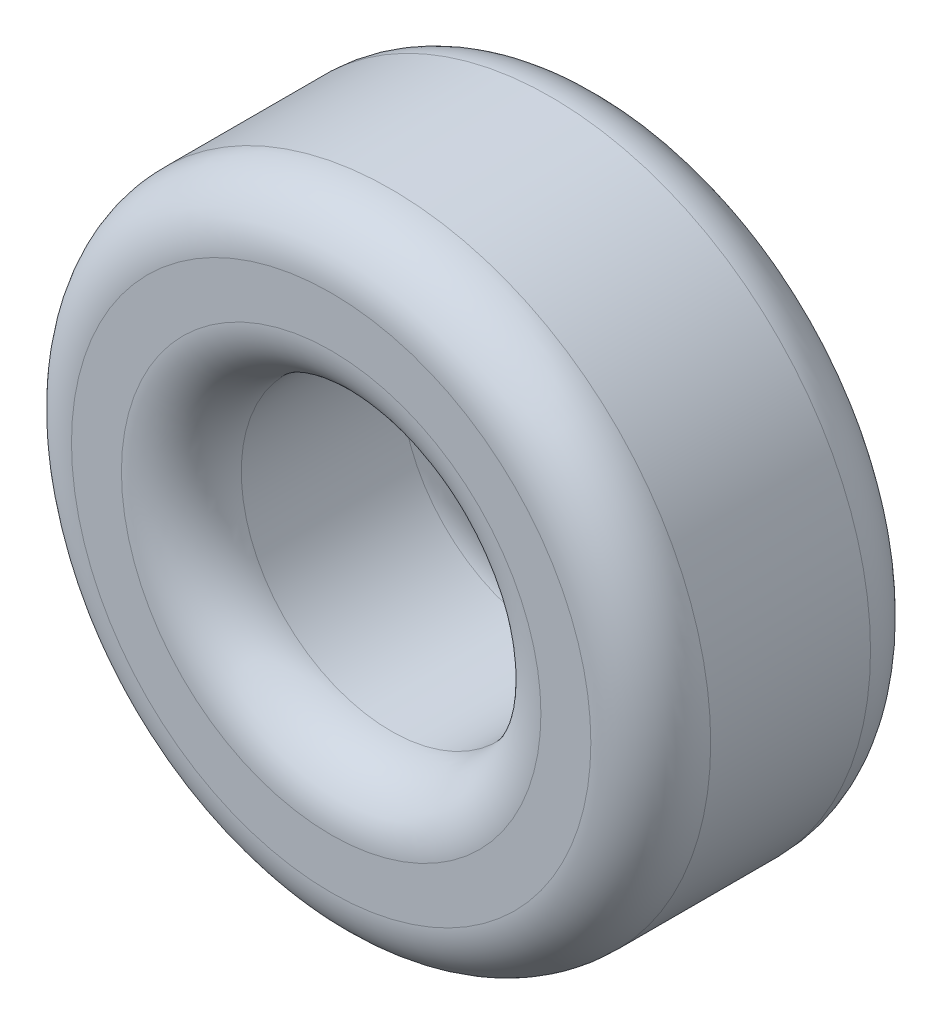
ISO-10303-21;
HEADER;
FILE_DESCRIPTION(('STEP AP214'),'2;1');
FILE_NAME('part.step','',(''),(''),'','','');
FILE_SCHEMA(('AUTOMOTIVE_DESIGN { 1 0 10303 214 1 1 1 1 }'));
ENDSEC;
DATA;
#1=APPLICATION_CONTEXT('core data for automotive mechanical design processes');
#2=APPLICATION_PROTOCOL_DEFINITION('international standard','automotive_design',2000,#1);
#3=PRODUCT_CONTEXT('',#1,'mechanical');
#4=PRODUCT('Part','Part','',(#3));
#5=PRODUCT_RELATED_PRODUCT_CATEGORY('part','',(#4));
#6=PRODUCT_DEFINITION_FORMATION('','',#4);
#7=PRODUCT_DEFINITION_CONTEXT('part definition',#1,'design');
#8=PRODUCT_DEFINITION('design','',#6,#7);
#9=PRODUCT_DEFINITION_SHAPE('','',#8);
#10=(LENGTH_UNIT() NAMED_UNIT(*) SI_UNIT(.MILLI.,.METRE.));
#11=(NAMED_UNIT(*) PLANE_ANGLE_UNIT() SI_UNIT($,.RADIAN.));
#12=(NAMED_UNIT(*) SI_UNIT($,.STERADIAN.) SOLID_ANGLE_UNIT());
#13=UNCERTAINTY_MEASURE_WITH_UNIT(LENGTH_MEASURE(1.E-05),#10,'distance_accuracy_value','');
#14=(GEOMETRIC_REPRESENTATION_CONTEXT(3) GLOBAL_UNCERTAINTY_ASSIGNED_CONTEXT((#13)) GLOBAL_UNIT_ASSIGNED_CONTEXT((#10,
#11,#12)) REPRESENTATION_CONTEXT('',''));
#15=CARTESIAN_POINT('',(0.,0.,0.));
#16=DIRECTION('',(0.,0.,1.));
#17=DIRECTION('',(1.,0.,0.));
#18=AXIS2_PLACEMENT_3D('',#15,#16,#17);
#19=CARTESIAN_POINT('',(0.,0.,0.7));
#20=DIRECTION('',(0.,0.,1.));
#21=DIRECTION('',(1.,0.,0.));
#22=AXIS2_PLACEMENT_3D('',#19,#20,#21);
#23=PLANE('',#22);
#24=CARTESIAN_POINT('',(0.,0.,0.7));
#25=DIRECTION('',(0.,0.,1.));
#26=DIRECTION('',(1.,0.,0.));
#27=AXIS2_PLACEMENT_3D('',#24,#25,#26);
#28=CIRCLE('',#27,1.05);
#29=CARTESIAN_POINT('',(1.05,0.,0.7));
#30=VERTEX_POINT('',#29);
#31=EDGE_CURVE('E10',#30,#30,#28,.F.);
#32=ORIENTED_EDGE('',*,*,#31,.T.);
#33=EDGE_LOOP('',(#32));
#34=FACE_BOUND('',#33,.T.);
#35=CARTESIAN_POINT('',(0.,0.,0.7));
#36=DIRECTION('',(0.,0.,1.));
#37=DIRECTION('',(1.,0.,0.));
#38=AXIS2_PLACEMENT_3D('',#35,#36,#37);
#39=CIRCLE('',#38,1.3);
#40=CARTESIAN_POINT('',(1.3,0.,0.7));
#41=VERTEX_POINT('',#40);
#42=EDGE_CURVE('E46',#41,#41,#39,.T.);
#43=ORIENTED_EDGE('',*,*,#42,.T.);
#44=EDGE_LOOP('',(#43));
#45=FACE_BOUND('',#44,.T.);
#46=ADVANCED_FACE('F39',(#34,#45),#23,.T.);
#47=CARTESIAN_POINT('',(0.,0.,-0.7));
#48=DIRECTION('',(0.,0.,1.));
#49=DIRECTION('',(1.,0.,0.));
#50=AXIS2_PLACEMENT_3D('',#47,#48,#49);
#51=PLANE('',#50);
#52=CARTESIAN_POINT('',(0.,0.,-0.7));
#53=DIRECTION('',(0.,0.,1.));
#54=DIRECTION('',(1.,0.,0.));
#55=AXIS2_PLACEMENT_3D('',#52,#53,#54);
#56=CIRCLE('',#55,1.05);
#57=CARTESIAN_POINT('',(1.05,0.,-0.7));
#58=VERTEX_POINT('',#57);
#59=EDGE_CURVE('E65',#58,#58,#56,.T.);
#60=ORIENTED_EDGE('',*,*,#59,.T.);
#61=EDGE_LOOP('',(#60));
#62=FACE_BOUND('',#61,.T.);
#63=CARTESIAN_POINT('',(0.,0.,-0.7));
#64=DIRECTION('',(0.,0.,1.));
#65=DIRECTION('',(1.,0.,0.));
#66=AXIS2_PLACEMENT_3D('',#63,#64,#65);
#67=CIRCLE('',#66,1.3);
#68=CARTESIAN_POINT('',(1.3,0.,-0.7));
#69=VERTEX_POINT('',#68);
#70=EDGE_CURVE('E68',#69,#69,#67,.F.);
#71=ORIENTED_EDGE('',*,*,#70,.T.);
#72=EDGE_LOOP('',(#71));
#73=FACE_BOUND('',#72,.T.);
#74=ADVANCED_FACE('F72',(#62,#73),#51,.F.);
#75=CARTESIAN_POINT('',(0.,0.,0.7));
#76=DIRECTION('',(0.,0.,-1.));
#77=DIRECTION('',(-1.,0.,0.));
#78=AXIS2_PLACEMENT_3D('',#75,#76,#77);
#79=CYLINDRICAL_SURFACE('',#78,1.6);
#80=CARTESIAN_POINT('',(0.,0.,-0.4));
#81=DIRECTION('',(0.,0.,1.));
#82=DIRECTION('',(1.,0.,0.));
#83=AXIS2_PLACEMENT_3D('',#80,#81,#82);
#84=CIRCLE('',#83,1.6);
#85=CARTESIAN_POINT('',(1.6,0.,-0.4));
#86=VERTEX_POINT('',#85);
#87=EDGE_CURVE('E50',#86,#86,#84,.T.);
#88=ORIENTED_EDGE('',*,*,#87,.T.);
#89=EDGE_LOOP('',(#88));
#90=FACE_BOUND('',#89,.T.);
#91=CARTESIAN_POINT('',(0.,0.,0.4));
#92=DIRECTION('',(0.,0.,1.));
#93=DIRECTION('',(1.,0.,0.));
#94=AXIS2_PLACEMENT_3D('',#91,#92,#93);
#95=CIRCLE('',#94,1.6);
#96=CARTESIAN_POINT('',(1.6,0.,0.4));
#97=VERTEX_POINT('',#96);
#98=EDGE_CURVE('E54',#97,#97,#95,.F.);
#99=ORIENTED_EDGE('',*,*,#98,.T.);
#100=EDGE_LOOP('',(#99));
#101=FACE_BOUND('',#100,.T.);
#102=ADVANCED_FACE('F82',(#90,#101),#79,.T.);
#103=CARTESIAN_POINT('',(0.,0.,0.7));
#104=DIRECTION('',(0.,0.,-1.));
#105=DIRECTION('',(-1.,0.,0.));
#106=AXIS2_PLACEMENT_3D('',#103,#104,#105);
#107=CYLINDRICAL_SURFACE('',#106,0.75);
#108=CARTESIAN_POINT('',(0.,0.,-0.4));
#109=DIRECTION('',(0.,0.,1.));
#110=DIRECTION('',(1.,0.,0.));
#111=AXIS2_PLACEMENT_3D('',#108,#109,#110);
#112=CIRCLE('',#111,0.75);
#113=CARTESIAN_POINT('',(0.75,0.,-0.4));
#114=VERTEX_POINT('',#113);
#115=EDGE_CURVE('E59',#114,#114,#112,.F.);
#116=ORIENTED_EDGE('',*,*,#115,.T.);
#117=EDGE_LOOP('',(#116));
#118=FACE_BOUND('',#117,.T.);
#119=CARTESIAN_POINT('',(0.,0.,0.4));
#120=DIRECTION('',(0.,0.,1.));
#121=DIRECTION('',(1.,0.,0.));
#122=AXIS2_PLACEMENT_3D('',#119,#120,#121);
#123=CIRCLE('',#122,0.75);
#124=CARTESIAN_POINT('',(0.75,0.,0.4));
#125=VERTEX_POINT('',#124);
#126=EDGE_CURVE('E62',#125,#125,#123,.T.);
#127=ORIENTED_EDGE('',*,*,#126,.T.);
#128=EDGE_LOOP('',(#127));
#129=FACE_BOUND('',#128,.T.);
#130=ADVANCED_FACE('F85',(#118,#129),#107,.F.);
#131=CARTESIAN_POINT('',(0.,0.,-0.4));
#132=DIRECTION('',(0.,0.,1.));
#133=DIRECTION('',(1.,0.,0.));
#134=AXIS2_PLACEMENT_3D('',#131,#132,#133);
#135=TOROIDAL_SURFACE('',#134,1.05,0.3);
#136=ORIENTED_EDGE('',*,*,#115,.F.);
#137=EDGE_LOOP('',(#136));
#138=FACE_BOUND('',#137,.T.);
#139=ORIENTED_EDGE('',*,*,#59,.F.);
#140=EDGE_LOOP('',(#139));
#141=FACE_BOUND('',#140,.T.);
#142=ADVANCED_FACE('F78',(#138,#141),#135,.T.);
#143=CARTESIAN_POINT('',(0.,0.,-0.4));
#144=DIRECTION('',(0.,0.,1.));
#145=DIRECTION('',(1.,0.,0.));
#146=AXIS2_PLACEMENT_3D('',#143,#144,#145);
#147=TOROIDAL_SURFACE('',#146,1.3,0.3);
#148=ORIENTED_EDGE('',*,*,#70,.F.);
#149=EDGE_LOOP('',(#148));
#150=FACE_BOUND('',#149,.T.);
#151=ORIENTED_EDGE('',*,*,#87,.F.);
#152=EDGE_LOOP('',(#151));
#153=FACE_BOUND('',#152,.T.);
#154=ADVANCED_FACE('F74',(#150,#153),#147,.T.);
#155=CARTESIAN_POINT('',(0.,0.,0.4));
#156=DIRECTION('',(0.,0.,1.));
#157=DIRECTION('',(1.,0.,0.));
#158=AXIS2_PLACEMENT_3D('',#155,#156,#157);
#159=TOROIDAL_SURFACE('',#158,1.05,0.3);
#160=ORIENTED_EDGE('',*,*,#31,.F.);
#161=EDGE_LOOP('',(#160));
#162=FACE_BOUND('',#161,.T.);
#163=ORIENTED_EDGE('',*,*,#126,.F.);
#164=EDGE_LOOP('',(#163));
#165=FACE_BOUND('',#164,.T.);
#166=ADVANCED_FACE('F77',(#162,#165),#159,.T.);
#167=CARTESIAN_POINT('',(0.,0.,0.4));
#168=DIRECTION('',(0.,0.,1.));
#169=DIRECTION('',(1.,0.,0.));
#170=AXIS2_PLACEMENT_3D('',#167,#168,#169);
#171=TOROIDAL_SURFACE('',#170,1.3,0.3);
#172=ORIENTED_EDGE('',*,*,#98,.F.);
#173=EDGE_LOOP('',(#172));
#174=FACE_BOUND('',#173,.T.);
#175=ORIENTED_EDGE('',*,*,#42,.F.);
#176=EDGE_LOOP('',(#175));
#177=FACE_BOUND('',#176,.T.);
#178=ADVANCED_FACE('F41',(#174,#177),#171,.T.);
#179=CLOSED_SHELL('',(#46,#74,#102,#130,#142,#154,#166,#178));
#180=MANIFOLD_SOLID_BREP('B2',#179);
#181=ADVANCED_BREP_SHAPE_REPRESENTATION('',(#18,#180),#14);
#182=SHAPE_DEFINITION_REPRESENTATION(#9,#181);
ENDSEC;
END-ISO-10303-21;
